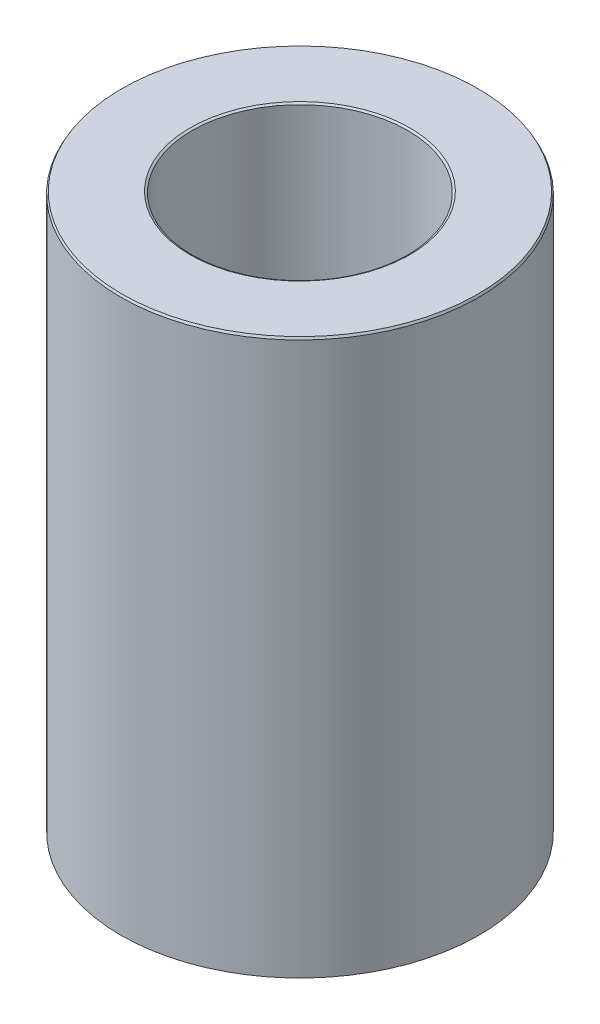
ISO-10303-21;
HEADER;
FILE_DESCRIPTION(('STEP AP214'),'2;1');
FILE_NAME('part.step','',(''),(''),'','','');
FILE_SCHEMA(('AUTOMOTIVE_DESIGN { 1 0 10303 214 1 1 1 1 }'));
ENDSEC;
DATA;
#1=APPLICATION_CONTEXT('core data for automotive mechanical design processes');
#2=APPLICATION_PROTOCOL_DEFINITION('international standard','automotive_design',2000,#1);
#3=PRODUCT_CONTEXT('',#1,'mechanical');
#4=PRODUCT('Part','Part','',(#3));
#5=PRODUCT_RELATED_PRODUCT_CATEGORY('part','',(#4));
#6=PRODUCT_DEFINITION_FORMATION('','',#4);
#7=PRODUCT_DEFINITION_CONTEXT('part definition',#1,'design');
#8=PRODUCT_DEFINITION('design','',#6,#7);
#9=PRODUCT_DEFINITION_SHAPE('','',#8);
#10=(LENGTH_UNIT() NAMED_UNIT(*) SI_UNIT(.MILLI.,.METRE.));
#11=(NAMED_UNIT(*) PLANE_ANGLE_UNIT() SI_UNIT($,.RADIAN.));
#12=(NAMED_UNIT(*) SI_UNIT($,.STERADIAN.) SOLID_ANGLE_UNIT());
#13=UNCERTAINTY_MEASURE_WITH_UNIT(LENGTH_MEASURE(1.E-05),#10,'distance_accuracy_value','');
#14=(GEOMETRIC_REPRESENTATION_CONTEXT(3) GLOBAL_UNCERTAINTY_ASSIGNED_CONTEXT((#13)) GLOBAL_UNIT_ASSIGNED_CONTEXT((#10,
#11,#12)) REPRESENTATION_CONTEXT('',''));
#15=CARTESIAN_POINT('',(0.,0.,0.));
#16=DIRECTION('',(0.,0.,1.));
#17=DIRECTION('',(1.,0.,0.));
#18=AXIS2_PLACEMENT_3D('',#15,#16,#17);
#19=CARTESIAN_POINT('',(0.,77.5545851524196,0.));
#20=DIRECTION('',(0.,-1.,0.));
#21=DIRECTION('',(0.,0.,-1.));
#22=AXIS2_PLACEMENT_3D('',#19,#20,#21);
#23=CYLINDRICAL_SURFACE('',#22,25.);
#24=CARTESIAN_POINT('',(0.,0.169581408081723,0.));
#25=DIRECTION('',(0.,1.,0.));
#26=DIRECTION('',(0.,0.,1.));
#27=AXIS2_PLACEMENT_3D('',#24,#25,#26);
#28=CIRCLE('',#27,25.);
#29=CARTESIAN_POINT('',(0.,0.169581408081723,25.));
#30=VERTEX_POINT('',#29);
#31=EDGE_CURVE('E10',#30,#30,#28,.T.);
#32=ORIENTED_EDGE('',*,*,#31,.T.);
#33=EDGE_LOOP('',(#32));
#34=FACE_BOUND('',#33,.T.);
#35=CARTESIAN_POINT('',(0.,77.260861537603,0.));
#36=DIRECTION('',(0.,1.,0.));
#37=DIRECTION('',(0.,0.,1.));
#38=AXIS2_PLACEMENT_3D('',#35,#36,#37);
#39=CIRCLE('',#38,25.);
#40=CARTESIAN_POINT('',(0.,77.260861537603,25.));
#41=VERTEX_POINT('',#40);
#42=EDGE_CURVE('E50',#41,#41,#39,.F.);
#43=ORIENTED_EDGE('',*,*,#42,.T.);
#44=EDGE_LOOP('',(#43));
#45=FACE_BOUND('',#44,.T.);
#46=ADVANCED_FACE('F39',(#34,#45),#23,.T.);
#47=CARTESIAN_POINT('',(0.,77.5545851524196,0.));
#48=DIRECTION('',(0.,1.,0.));
#49=DIRECTION('',(0.,0.,1.));
#50=AXIS2_PLACEMENT_3D('',#47,#48,#49);
#51=PLANE('',#50);
#52=CARTESIAN_POINT('',(0.,77.5545851524196,0.));
#53=DIRECTION('',(0.,1.,0.));
#54=DIRECTION('',(0.,0.,1.));
#55=AXIS2_PLACEMENT_3D('',#52,#53,#54);
#56=CIRCLE('',#55,15.3373119952486);
#57=CARTESIAN_POINT('',(0.,77.5545851524196,15.3373119952486));
#58=VERTEX_POINT('',#57);
#59=EDGE_CURVE('E58',#58,#58,#56,.F.);
#60=ORIENTED_EDGE('',*,*,#59,.T.);
#61=EDGE_LOOP('',(#60));
#62=FACE_BOUND('',#61,.T.);
#63=CARTESIAN_POINT('',(0.,77.5545851524196,0.));
#64=DIRECTION('',(0.,1.,0.));
#65=DIRECTION('',(0.,0.,1.));
#66=AXIS2_PLACEMENT_3D('',#63,#64,#65);
#67=CIRCLE('',#66,24.8304185919183);
#68=CARTESIAN_POINT('',(0.,77.5545851524196,24.8304185919183));
#69=VERTEX_POINT('',#68);
#70=EDGE_CURVE('E61',#69,#69,#67,.T.);
#71=ORIENTED_EDGE('',*,*,#70,.T.);
#72=EDGE_LOOP('',(#71));
#73=FACE_BOUND('',#72,.T.);
#74=ADVANCED_FACE('F88',(#62,#73),#51,.T.);
#75=CARTESIAN_POINT('',(0.,0.,0.));
#76=DIRECTION('',(0.,1.,0.));
#77=DIRECTION('',(0.,0.,1.));
#78=AXIS2_PLACEMENT_3D('',#75,#76,#77);
#79=PLANE('',#78);
#80=CARTESIAN_POINT('',(0.,0.,0.));
#81=DIRECTION('',(0.,1.,0.));
#82=DIRECTION('',(0.,0.,1.));
#83=AXIS2_PLACEMENT_3D('',#80,#81,#82);
#84=CIRCLE('',#83,15.2131697885138);
#85=CARTESIAN_POINT('',(0.,0.,-15.2131697885138));
#86=VERTEX_POINT('',#85);
#87=EDGE_CURVE('E51',#86,#86,#84,.T.);
#88=ORIENTED_EDGE('',*,*,#87,.T.);
#89=EDGE_LOOP('',(#88));
#90=FACE_BOUND('',#89,.T.);
#91=CARTESIAN_POINT('',(0.,0.,0.));
#92=DIRECTION('',(0.,1.,0.));
#93=DIRECTION('',(0.,0.,1.));
#94=AXIS2_PLACEMENT_3D('',#91,#92,#93);
#95=CIRCLE('',#94,24.7062763851834);
#96=CARTESIAN_POINT('',(0.,0.,24.7062763851834));
#97=VERTEX_POINT('',#96);
#98=EDGE_CURVE('E54',#97,#97,#95,.F.);
#99=ORIENTED_EDGE('',*,*,#98,.T.);
#100=EDGE_LOOP('',(#99));
#101=FACE_BOUND('',#100,.T.);
#102=ADVANCED_FACE('F83',(#90,#101),#79,.F.);
#103=CARTESIAN_POINT('',(0.,77.5545851524196,0.));
#104=DIRECTION('',(0.,-1.,0.));
#105=DIRECTION('',(0.,0.,-1.));
#106=AXIS2_PLACEMENT_3D('',#103,#104,#105);
#107=CYLINDRICAL_SURFACE('',#106,15.043588380432);
#108=CARTESIAN_POINT('',(0.,77.3850037443379,0.));
#109=DIRECTION('',(0.,1.,0.));
#110=DIRECTION('',(0.,0.,1.));
#111=AXIS2_PLACEMENT_3D('',#108,#109,#110);
#112=CIRCLE('',#111,15.043588380432);
#113=CARTESIAN_POINT('',(0.,77.3850037443379,15.043588380432));
#114=VERTEX_POINT('',#113);
#115=EDGE_CURVE('E67',#114,#114,#112,.T.);
#116=ORIENTED_EDGE('',*,*,#115,.T.);
#117=EDGE_LOOP('',(#116));
#118=FACE_BOUND('',#117,.T.);
#119=CARTESIAN_POINT('',(0.,0.29372361481661,0.));
#120=DIRECTION('',(0.,1.,0.));
#121=DIRECTION('',(0.,0.,1.));
#122=AXIS2_PLACEMENT_3D('',#119,#120,#121);
#123=CIRCLE('',#122,15.043588380432);
#124=CARTESIAN_POINT('',(0.,0.29372361481661,-15.043588380432));
#125=VERTEX_POINT('',#124);
#126=EDGE_CURVE('E69',#125,#125,#123,.F.);
#127=ORIENTED_EDGE('',*,*,#126,.T.);
#128=EDGE_LOOP('',(#127));
#129=FACE_BOUND('',#128,.T.);
#130=ADVANCED_FACE('F71',(#118,#129),#107,.F.);
#131=CARTESIAN_POINT('',(0.,77.3850037443379,0.));
#132=DIRECTION('',(0.,1.,0.));
#133=DIRECTION('',(0.,0.,1.));
#134=AXIS2_PLACEMENT_3D('',#131,#132,#133);
#135=CONICAL_SURFACE('',#134,15.043588380432,1.04719755119659);
#136=ORIENTED_EDGE('',*,*,#59,.F.);
#137=EDGE_LOOP('',(#136));
#138=FACE_BOUND('',#137,.T.);
#139=ORIENTED_EDGE('',*,*,#115,.F.);
#140=EDGE_LOOP('',(#139));
#141=FACE_BOUND('',#140,.T.);
#142=ADVANCED_FACE('F77',(#138,#141),#135,.F.);
#143=CARTESIAN_POINT('',(0.,0.,0.));
#144=DIRECTION('',(0.,-1.,0.));
#145=DIRECTION('',(0.,0.,-1.));
#146=AXIS2_PLACEMENT_3D('',#143,#144,#145);
#147=CONICAL_SURFACE('',#146,15.2131697885138,0.523598775598299);
#148=CARTESIAN_POINT('',(0.,0.29372361481661,-15.043588380432));
#149=CARTESIAN_POINT('',(0.,0.290663993828937,-15.0453548534329));
#150=CARTESIAN_POINT('',(0.,0.287604372841264,-15.0471213264337));
#151=CARTESIAN_POINT('',(0.,0.281485130865918,-15.0506542724354));
#152=CARTESIAN_POINT('',(0.,0.278425509878245,-15.0524207454363));
#153=CARTESIAN_POINT('',(0.,0.272306267902899,-15.055953691438));
#154=CARTESIAN_POINT('',(0.,0.269246646915226,-15.0577201644388));
#155=CARTESIAN_POINT('',(0.,0.26312740493988,-15.0612531104405));
#156=CARTESIAN_POINT('',(0.,0.260067783952207,-15.0630195834414));
#157=CARTESIAN_POINT('',(0.,0.253948541976861,-15.0665525294431));
#158=CARTESIAN_POINT('',(0.,0.250888920989188,-15.068319002444));
#159=CARTESIAN_POINT('',(0.,0.244769679013842,-15.0718519484457));
#160=CARTESIAN_POINT('',(0.,0.241710058026169,-15.0736184214465));
#161=CARTESIAN_POINT('',(0.,0.235590816050823,-15.0771513674482));
#162=CARTESIAN_POINT('',(0.,0.232531195063149,-15.0789178404491));
#163=CARTESIAN_POINT('',(0.,0.226411953087803,-15.0824507864508));
#164=CARTESIAN_POINT('',(0.,0.223352332100131,-15.0842172594516));
#165=CARTESIAN_POINT('',(0.,0.217233090124785,-15.0877502054533));
#166=CARTESIAN_POINT('',(0.,0.214173469137111,-15.0895166784542));
#167=CARTESIAN_POINT('',(0.,0.208054227161765,-15.0930496244559));
#168=CARTESIAN_POINT('',(0.,0.204994606174092,-15.0948160974567));
#169=CARTESIAN_POINT('',(0.,0.198875364198746,-15.0983490434584));
#170=CARTESIAN_POINT('',(0.,0.195815743211073,-15.1001155164593));
#171=CARTESIAN_POINT('',(0.,0.189696501235727,-15.103648462461));
#172=CARTESIAN_POINT('',(0.,0.186636880248054,-15.1054149354618));
#173=CARTESIAN_POINT('',(0.,0.180517638272708,-15.1089478814635));
#174=CARTESIAN_POINT('',(0.,0.177458017285035,-15.1107143544644));
#175=CARTESIAN_POINT('',(0.,0.171338775309689,-15.1142473004661));
#176=CARTESIAN_POINT('',(0.,0.168279154322016,-15.1160137734669));
#177=CARTESIAN_POINT('',(0.,0.16215991234667,-15.1195467194686));
#178=CARTESIAN_POINT('',(0.,0.159100291358997,-15.1213131924695));
#179=CARTESIAN_POINT('',(0.,0.152981049383651,-15.1248461384712));
#180=CARTESIAN_POINT('',(0.,0.149921428395978,-15.126612611472));
#181=CARTESIAN_POINT('',(0.,0.143802186420632,-15.1301455574737));
#182=CARTESIAN_POINT('',(0.,0.140742565432959,-15.1319120304746));
#183=CARTESIAN_POINT('',(0.,0.134623323457613,-15.1354449764763));
#184=CARTESIAN_POINT('',(0.,0.13156370246994,-15.1372114494771));
#185=CARTESIAN_POINT('',(0.,0.125444460494594,-15.1407443954789));
#186=CARTESIAN_POINT('',(0.,0.122384839506921,-15.1425108684797));
#187=CARTESIAN_POINT('',(0.,0.116265597531575,-15.1460438144814));
#188=CARTESIAN_POINT('',(0.,0.113205976543902,-15.1478102874823));
#189=CARTESIAN_POINT('',(0.,0.107086734568556,-15.151343233484));
#190=CARTESIAN_POINT('',(0.,0.104027113580883,-15.1531097064848));
#191=CARTESIAN_POINT('',(0.,0.0979078716055367,-15.1566426524865));
#192=CARTESIAN_POINT('',(0.,0.0948482506178636,-15.1584091254874));
#193=CARTESIAN_POINT('',(0.,0.0887290086425176,-15.1619420714891));
#194=CARTESIAN_POINT('',(0.,0.0856693876548446,-15.1637085444899));
#195=CARTESIAN_POINT('',(0.,0.0795501456794985,-15.1672414904916));
#196=CARTESIAN_POINT('',(0.,0.0764905246918254,-15.1690079634925));
#197=CARTESIAN_POINT('',(0.,0.0703712827164794,-15.1725409094942));
#198=CARTESIAN_POINT('',(0.,0.0673116617288065,-15.174307382495));
#199=CARTESIAN_POINT('',(0.,0.0611924197534606,-15.1778403284967));
#200=CARTESIAN_POINT('',(0.,0.0581327987657874,-15.1796068014976));
#201=CARTESIAN_POINT('',(0.,0.0520135567904413,-15.1831397474993));
#202=CARTESIAN_POINT('',(0.,0.0489539358027683,-15.1849062205001));
#203=CARTESIAN_POINT('',(0.,0.0428346938274223,-15.1884391665018));
#204=CARTESIAN_POINT('',(0.,0.0397750728397493,-15.1902056395027));
#205=CARTESIAN_POINT('',(0.,0.0336558308644032,-15.1937385855044));
#206=CARTESIAN_POINT('',(0.,0.03059620987673,-15.1955050585052));
#207=CARTESIAN_POINT('',(0.,0.0244769679013841,-15.1990380045069));
#208=CARTESIAN_POINT('',(0.,0.0214173469137112,-15.2008044775078));
#209=CARTESIAN_POINT('',(0.,0.0152981049383653,-15.2043374235095));
#210=CARTESIAN_POINT('',(0.,0.0122384839506922,-15.2061038965103));
#211=CARTESIAN_POINT('',(0.,0.00611924197534596,-15.209636842512));
#212=CARTESIAN_POINT('',(0.,0.00305962098767286,-15.2114033155129));
#213=CARTESIAN_POINT('',(0.,0.,-15.2131697885138));
#214=B_SPLINE_CURVE_WITH_KNOTS('',3,(#148,#149,#150,#151,#152,#153,#154,#155,#156,#157,#158,
#159,#160,#161,#162,#163,#164,#165,#166,#167,#168,#169,#170,#171,#172,#173,#174,#175,#176,#177,
#178,#179,#180,#181,#182,#183,#184,#185,#186,#187,#188,#189,#190,#191,#192,#193,#194,#195,#196,
#197,#198,#199,#200,#201,#202,#203,#204,#205,#206,#207,#208,#209,#210,#211,#212,#213),
.UNSPECIFIED.,.F.,.F.,(4,2,2,2,2,2,2,2,2,2,2,2,2,2,2,2,2,2,2,2,2,2,2,2,2,2,2,2,2,2,2,2,4),(0.,
0.0105988380051073,0.0211976760102146,0.0317965140153228,0.0423953520204301,0.0529941900255375,
0.0635930280306448,0.0741918660357521,0.0847907040408603,0.0953895420459676,0.105988380051075,
0.116587218056182,0.12718605606129,0.137784894066397,0.148383732071505,0.158982570076612,
0.16958140808172,0.180180246086827,0.190779084091934,0.201377922097043,0.21197676010215,
0.222575598107257,0.233174436112364,0.243773274117472,0.254372112122579,0.264970950127687,
0.275569788132795,0.286168626137902,0.296767464143009,0.307366302148117,0.317965140153225,
0.328563978158332,0.339162816163439),.UNSPECIFIED.);
#215=EDGE_CURVE('BSEAM73',#125,#86,#214,.T.);
#216=ORIENTED_EDGE('',*,*,#126,.F.);
#217=ORIENTED_EDGE('',*,*,#87,.F.);
#218=ORIENTED_EDGE('',*,*,#215,.T.);
#219=ORIENTED_EDGE('',*,*,#215,.F.);
#220=EDGE_LOOP('',(#216,#218,#217,#219));
#221=FACE_BOUND('',#220,.T.);
#222=ADVANCED_FACE('F73',(#221),#147,.F.);
#223=CARTESIAN_POINT('',(0.,0.169581408081723,0.));
#224=DIRECTION('',(0.,1.,0.));
#225=DIRECTION('',(0.,0.,1.));
#226=AXIS2_PLACEMENT_3D('',#223,#224,#225);
#227=CONICAL_SURFACE('',#226,25.,1.0471975511966);
#228=ORIENTED_EDGE('',*,*,#98,.F.);
#229=EDGE_LOOP('',(#228));
#230=FACE_BOUND('',#229,.T.);
#231=ORIENTED_EDGE('',*,*,#31,.F.);
#232=EDGE_LOOP('',(#231));
#233=FACE_BOUND('',#232,.T.);
#234=ADVANCED_FACE('F76',(#230,#233),#227,.T.);
#235=CARTESIAN_POINT('',(0.,77.5545851524196,0.));
#236=DIRECTION('',(0.,-1.,0.));
#237=DIRECTION('',(0.,0.,-1.));
#238=AXIS2_PLACEMENT_3D('',#235,#236,#237);
#239=CONICAL_SURFACE('',#238,24.8304185919183,0.523598775598284);
#240=ORIENTED_EDGE('',*,*,#42,.F.);
#241=EDGE_LOOP('',(#240));
#242=FACE_BOUND('',#241,.T.);
#243=ORIENTED_EDGE('',*,*,#70,.F.);
#244=EDGE_LOOP('',(#243));
#245=FACE_BOUND('',#244,.T.);
#246=ADVANCED_FACE('F45',(#242,#245),#239,.T.);
#247=CLOSED_SHELL('',(#46,#74,#102,#130,#142,#222,#234,#246));
#248=MANIFOLD_SOLID_BREP('B2',#247);
#249=ADVANCED_BREP_SHAPE_REPRESENTATION('',(#18,#248),#14);
#250=SHAPE_DEFINITION_REPRESENTATION(#9,#249);
ENDSEC;
END-ISO-10303-21;
